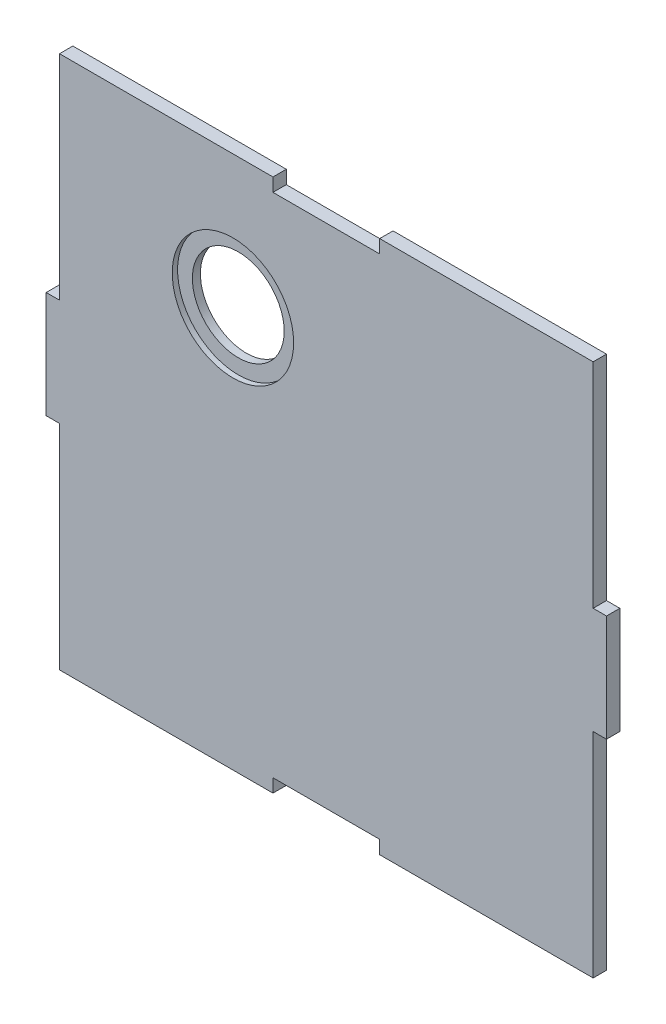
ISO-10303-21;
HEADER;
FILE_DESCRIPTION(('STEP AP214'),'2;1');
FILE_NAME('part.step','',(''),(''),'','','');
FILE_SCHEMA(('AUTOMOTIVE_DESIGN { 1 0 10303 214 1 1 1 1 }'));
ENDSEC;
DATA;
#1=APPLICATION_CONTEXT('core data for automotive mechanical design processes');
#2=APPLICATION_PROTOCOL_DEFINITION('international standard','automotive_design',2000,#1);
#3=PRODUCT_CONTEXT('',#1,'mechanical');
#4=PRODUCT('Part','Part','',(#3));
#5=PRODUCT_RELATED_PRODUCT_CATEGORY('part','',(#4));
#6=PRODUCT_DEFINITION_FORMATION('','',#4);
#7=PRODUCT_DEFINITION_CONTEXT('part definition',#1,'design');
#8=PRODUCT_DEFINITION('design','',#6,#7);
#9=PRODUCT_DEFINITION_SHAPE('','',#8);
#10=(LENGTH_UNIT() NAMED_UNIT(*) SI_UNIT(.MILLI.,.METRE.));
#11=(NAMED_UNIT(*) PLANE_ANGLE_UNIT() SI_UNIT($,.RADIAN.));
#12=(NAMED_UNIT(*) SI_UNIT($,.STERADIAN.) SOLID_ANGLE_UNIT());
#13=UNCERTAINTY_MEASURE_WITH_UNIT(LENGTH_MEASURE(1.E-05),#10,'distance_accuracy_value','');
#14=(GEOMETRIC_REPRESENTATION_CONTEXT(3) GLOBAL_UNCERTAINTY_ASSIGNED_CONTEXT((#13)) GLOBAL_UNIT_ASSIGNED_CONTEXT((#10,
#11,#12)) REPRESENTATION_CONTEXT('',''));
#15=CARTESIAN_POINT('',(0.,0.,0.));
#16=DIRECTION('',(0.,0.,1.));
#17=DIRECTION('',(1.,0.,0.));
#18=AXIS2_PLACEMENT_3D('',#15,#16,#17);
#19=CARTESIAN_POINT('',(-35.,50.,0.));
#20=DIRECTION('',(0.,0.,1.));
#21=DIRECTION('',(1.,0.,0.));
#22=AXIS2_PLACEMENT_3D('',#19,#20,#21);
#23=CYLINDRICAL_SURFACE('',#22,17.2);
#24=CARTESIAN_POINT('',(-35.,50.,0.));
#25=DIRECTION('',(0.,0.,1.));
#26=DIRECTION('',(1.,0.,0.));
#27=AXIS2_PLACEMENT_3D('',#24,#25,#26);
#28=CIRCLE('',#27,17.2);
#29=CARTESIAN_POINT('',(-17.8,50.,0.));
#30=VERTEX_POINT('',#29);
#31=EDGE_CURVE('E206',#30,#30,#28,.T.);
#32=ORIENTED_EDGE('',*,*,#31,.F.);
#33=EDGE_LOOP('',(#32));
#34=FACE_BOUND('',#33,.T.);
#35=CARTESIAN_POINT('',(-35.,50.,3.));
#36=DIRECTION('',(0.,0.,1.));
#37=DIRECTION('',(1.,0.,0.));
#38=AXIS2_PLACEMENT_3D('',#35,#36,#37);
#39=CIRCLE('',#38,17.2);
#40=CARTESIAN_POINT('',(-17.8,50.,3.));
#41=VERTEX_POINT('',#40);
#42=EDGE_CURVE('E36',#41,#41,#39,.F.);
#43=ORIENTED_EDGE('',*,*,#42,.F.);
#44=EDGE_LOOP('',(#43));
#45=FACE_BOUND('',#44,.T.);
#46=ADVANCED_FACE('F32',(#34,#45),#23,.F.);
#47=CARTESIAN_POINT('',(99.9999999999999,20.,5.));
#48=DIRECTION('',(-1.,0.,0.));
#49=DIRECTION('',(0.,-1.,0.));
#50=AXIS2_PLACEMENT_3D('',#47,#48,#49);
#51=PLANE('',#50);
#52=DIRECTION('',(0.,1.,0.));
#53=VECTOR('',#52,1.);
#54=CARTESIAN_POINT('',(99.9999999999999,20.,0.));
#55=LINE('',#54,#53);
#56=CARTESIAN_POINT('',(99.9999999999999,20.,0.));
#57=VERTEX_POINT('',#56);
#58=CARTESIAN_POINT('',(100.,100.,0.));
#59=VERTEX_POINT('',#58);
#60=EDGE_CURVE('E202',#57,#59,#55,.T.);
#61=ORIENTED_EDGE('',*,*,#60,.T.);
#62=DIRECTION('',(0.,0.,-1.));
#63=VECTOR('',#62,1.);
#64=CARTESIAN_POINT('',(100.,100.,5.));
#65=LINE('',#64,#63);
#66=CARTESIAN_POINT('',(100.,100.,5.));
#67=VERTEX_POINT('',#66);
#68=EDGE_CURVE('E11',#67,#59,#65,.T.);
#69=ORIENTED_EDGE('',*,*,#68,.F.);
#70=DIRECTION('',(0.,1.,0.));
#71=VECTOR('',#70,1.);
#72=CARTESIAN_POINT('',(99.9999999999999,20.,5.));
#73=LINE('',#72,#71);
#74=CARTESIAN_POINT('',(99.9999999999999,20.,5.));
#75=VERTEX_POINT('',#74);
#76=EDGE_CURVE('E241',#75,#67,#73,.T.);
#77=ORIENTED_EDGE('',*,*,#76,.F.);
#78=DIRECTION('',(0.,0.,-1.));
#79=VECTOR('',#78,1.);
#80=CARTESIAN_POINT('',(99.9999999999999,20.,5.));
#81=LINE('',#80,#79);
#82=EDGE_CURVE('E198',#75,#57,#81,.T.);
#83=ORIENTED_EDGE('',*,*,#82,.T.);
#84=EDGE_LOOP('',(#61,#69,#77,#83));
#85=FACE_BOUND('',#84,.T.);
#86=ADVANCED_FACE('F34',(#85),#51,.F.);
#87=CARTESIAN_POINT('',(20.,100.,5.));
#88=DIRECTION('',(0.,-1.,0.));
#89=DIRECTION('',(1.,0.,0.));
#90=AXIS2_PLACEMENT_3D('',#87,#88,#89);
#91=PLANE('',#90);
#92=DIRECTION('',(-1.,0.,0.));
#93=VECTOR('',#92,1.);
#94=CARTESIAN_POINT('',(20.,100.,0.));
#95=LINE('',#94,#93);
#96=CARTESIAN_POINT('',(20.,100.,0.));
#97=VERTEX_POINT('',#96);
#98=EDGE_CURVE('E205',#59,#97,#95,.T.);
#99=ORIENTED_EDGE('',*,*,#98,.T.);
#100=DIRECTION('',(0.,0.,-1.));
#101=VECTOR('',#100,1.);
#102=CARTESIAN_POINT('',(20.,100.,5.));
#103=LINE('',#102,#101);
#104=CARTESIAN_POINT('',(20.,100.,5.));
#105=VERTEX_POINT('',#104);
#106=EDGE_CURVE('E42',#105,#97,#103,.T.);
#107=ORIENTED_EDGE('',*,*,#106,.F.);
#108=DIRECTION('',(-1.,0.,0.));
#109=VECTOR('',#108,1.);
#110=CARTESIAN_POINT('',(20.,100.,5.));
#111=LINE('',#110,#109);
#112=EDGE_CURVE('E129',#67,#105,#111,.T.);
#113=ORIENTED_EDGE('',*,*,#112,.F.);
#114=ORIENTED_EDGE('',*,*,#68,.T.);
#115=EDGE_LOOP('',(#99,#107,#113,#114));
#116=FACE_BOUND('',#115,.T.);
#117=ADVANCED_FACE('F369',(#116),#91,.F.);
#118=CARTESIAN_POINT('',(20.,100.,5.));
#119=DIRECTION('',(1.,0.,0.));
#120=DIRECTION('',(0.,1.,0.));
#121=AXIS2_PLACEMENT_3D('',#118,#119,#120);
#122=PLANE('',#121);
#123=DIRECTION('',(0.,-1.,0.));
#124=VECTOR('',#123,1.);
#125=CARTESIAN_POINT('',(20.,100.,0.));
#126=LINE('',#125,#124);
#127=CARTESIAN_POINT('',(20.,95.,0.));
#128=VERTEX_POINT('',#127);
#129=EDGE_CURVE('E208',#97,#128,#126,.T.);
#130=ORIENTED_EDGE('',*,*,#129,.T.);
#131=DIRECTION('',(0.,0.,-1.));
#132=VECTOR('',#131,1.);
#133=CARTESIAN_POINT('',(20.,95.,5.));
#134=LINE('',#133,#132);
#135=CARTESIAN_POINT('',(20.,95.,5.));
#136=VERTEX_POINT('',#135);
#137=EDGE_CURVE('E284',#136,#128,#134,.T.);
#138=ORIENTED_EDGE('',*,*,#137,.F.);
#139=DIRECTION('',(0.,-1.,0.));
#140=VECTOR('',#139,1.);
#141=CARTESIAN_POINT('',(20.,100.,5.));
#142=LINE('',#141,#140);
#143=EDGE_CURVE('E293',#105,#136,#142,.T.);
#144=ORIENTED_EDGE('',*,*,#143,.F.);
#145=ORIENTED_EDGE('',*,*,#106,.T.);
#146=EDGE_LOOP('',(#130,#138,#144,#145));
#147=FACE_BOUND('',#146,.T.);
#148=ADVANCED_FACE('F291',(#147),#122,.F.);
#149=CARTESIAN_POINT('',(-20.,95.,5.));
#150=DIRECTION('',(0.,-1.,0.));
#151=DIRECTION('',(0.,0.,-1.));
#152=AXIS2_PLACEMENT_3D('',#149,#150,#151);
#153=PLANE('',#152);
#154=DIRECTION('',(-1.,0.,0.));
#155=VECTOR('',#154,1.);
#156=CARTESIAN_POINT('',(-20.,95.,0.));
#157=LINE('',#156,#155);
#158=CARTESIAN_POINT('',(-20.,95.,0.));
#159=VERTEX_POINT('',#158);
#160=EDGE_CURVE('E210',#128,#159,#157,.T.);
#161=ORIENTED_EDGE('',*,*,#160,.T.);
#162=DIRECTION('',(0.,0.,-1.));
#163=VECTOR('',#162,1.);
#164=CARTESIAN_POINT('',(-20.,95.,5.));
#165=LINE('',#164,#163);
#166=CARTESIAN_POINT('',(-20.,95.,5.));
#167=VERTEX_POINT('',#166);
#168=EDGE_CURVE('E281',#167,#159,#165,.T.);
#169=ORIENTED_EDGE('',*,*,#168,.F.);
#170=DIRECTION('',(-1.,0.,0.));
#171=VECTOR('',#170,1.);
#172=CARTESIAN_POINT('',(-20.,95.,5.));
#173=LINE('',#172,#171);
#174=EDGE_CURVE('E311',#136,#167,#173,.T.);
#175=ORIENTED_EDGE('',*,*,#174,.F.);
#176=ORIENTED_EDGE('',*,*,#137,.T.);
#177=EDGE_LOOP('',(#161,#169,#175,#176));
#178=FACE_BOUND('',#177,.T.);
#179=ADVANCED_FACE('F302',(#178),#153,.F.);
#180=CARTESIAN_POINT('',(-20.,100.,5.));
#181=DIRECTION('',(-1.,0.,0.));
#182=DIRECTION('',(0.,-1.,0.));
#183=AXIS2_PLACEMENT_3D('',#180,#181,#182);
#184=PLANE('',#183);
#185=DIRECTION('',(0.,1.,0.));
#186=VECTOR('',#185,1.);
#187=CARTESIAN_POINT('',(-20.,100.,0.));
#188=LINE('',#187,#186);
#189=CARTESIAN_POINT('',(-20.,100.,0.));
#190=VERTEX_POINT('',#189);
#191=EDGE_CURVE('E212',#159,#190,#188,.T.);
#192=ORIENTED_EDGE('',*,*,#191,.T.);
#193=DIRECTION('',(0.,0.,-1.));
#194=VECTOR('',#193,1.);
#195=CARTESIAN_POINT('',(-20.,100.,5.));
#196=LINE('',#195,#194);
#197=CARTESIAN_POINT('',(-20.,100.,5.));
#198=VERTEX_POINT('',#197);
#199=EDGE_CURVE('E278',#198,#190,#196,.T.);
#200=ORIENTED_EDGE('',*,*,#199,.F.);
#201=DIRECTION('',(0.,1.,0.));
#202=VECTOR('',#201,1.);
#203=CARTESIAN_POINT('',(-20.,100.,5.));
#204=LINE('',#203,#202);
#205=EDGE_CURVE('E308',#167,#198,#204,.T.);
#206=ORIENTED_EDGE('',*,*,#205,.F.);
#207=ORIENTED_EDGE('',*,*,#168,.T.);
#208=EDGE_LOOP('',(#192,#200,#206,#207));
#209=FACE_BOUND('',#208,.T.);
#210=ADVANCED_FACE('F306',(#209),#184,.F.);
#211=CARTESIAN_POINT('',(-100.,100.,5.));
#212=DIRECTION('',(0.,-1.,0.));
#213=DIRECTION('',(1.,0.,0.));
#214=AXIS2_PLACEMENT_3D('',#211,#212,#213);
#215=PLANE('',#214);
#216=DIRECTION('',(-1.,0.,0.));
#217=VECTOR('',#216,1.);
#218=CARTESIAN_POINT('',(-100.,100.,0.));
#219=LINE('',#218,#217);
#220=CARTESIAN_POINT('',(-100.,100.,0.));
#221=VERTEX_POINT('',#220);
#222=EDGE_CURVE('E214',#190,#221,#219,.T.);
#223=ORIENTED_EDGE('',*,*,#222,.T.);
#224=DIRECTION('',(0.,0.,-1.));
#225=VECTOR('',#224,1.);
#226=CARTESIAN_POINT('',(-100.,100.,5.));
#227=LINE('',#226,#225);
#228=CARTESIAN_POINT('',(-100.,100.,5.));
#229=VERTEX_POINT('',#228);
#230=EDGE_CURVE('E275',#229,#221,#227,.T.);
#231=ORIENTED_EDGE('',*,*,#230,.F.);
#232=DIRECTION('',(-1.,0.,0.));
#233=VECTOR('',#232,1.);
#234=CARTESIAN_POINT('',(-100.,100.,5.));
#235=LINE('',#234,#233);
#236=EDGE_CURVE('E310',#198,#229,#235,.T.);
#237=ORIENTED_EDGE('',*,*,#236,.F.);
#238=ORIENTED_EDGE('',*,*,#199,.T.);
#239=EDGE_LOOP('',(#223,#231,#237,#238));
#240=FACE_BOUND('',#239,.T.);
#241=ADVANCED_FACE('F529',(#240),#215,.F.);
#242=CARTESIAN_POINT('',(-100.,20.,5.));
#243=DIRECTION('',(1.,0.,0.));
#244=DIRECTION('',(0.,1.,0.));
#245=AXIS2_PLACEMENT_3D('',#242,#243,#244);
#246=PLANE('',#245);
#247=DIRECTION('',(0.,-1.,0.));
#248=VECTOR('',#247,1.);
#249=CARTESIAN_POINT('',(-100.,20.,0.));
#250=LINE('',#249,#248);
#251=CARTESIAN_POINT('',(-100.,20.,0.));
#252=VERTEX_POINT('',#251);
#253=EDGE_CURVE('E216',#221,#252,#250,.T.);
#254=ORIENTED_EDGE('',*,*,#253,.T.);
#255=DIRECTION('',(0.,0.,-1.));
#256=VECTOR('',#255,1.);
#257=CARTESIAN_POINT('',(-100.,20.,5.));
#258=LINE('',#257,#256);
#259=CARTESIAN_POINT('',(-100.,20.,5.));
#260=VERTEX_POINT('',#259);
#261=EDGE_CURVE('E272',#260,#252,#258,.T.);
#262=ORIENTED_EDGE('',*,*,#261,.F.);
#263=DIRECTION('',(0.,-1.,0.));
#264=VECTOR('',#263,1.);
#265=CARTESIAN_POINT('',(-100.,20.,5.));
#266=LINE('',#265,#264);
#267=EDGE_CURVE('E313',#229,#260,#266,.T.);
#268=ORIENTED_EDGE('',*,*,#267,.F.);
#269=ORIENTED_EDGE('',*,*,#230,.T.);
#270=EDGE_LOOP('',(#254,#262,#268,#269));
#271=FACE_BOUND('',#270,.T.);
#272=ADVANCED_FACE('F520',(#271),#246,.F.);
#273=CARTESIAN_POINT('',(-100.,20.,5.));
#274=DIRECTION('',(0.,-1.,0.));
#275=DIRECTION('',(1.,0.,0.));
#276=AXIS2_PLACEMENT_3D('',#273,#274,#275);
#277=PLANE('',#276);
#278=DIRECTION('',(-1.,0.,0.));
#279=VECTOR('',#278,1.);
#280=CARTESIAN_POINT('',(-100.,20.,0.));
#281=LINE('',#280,#279);
#282=CARTESIAN_POINT('',(-105.,20.,0.));
#283=VERTEX_POINT('',#282);
#284=EDGE_CURVE('E218',#252,#283,#281,.T.);
#285=ORIENTED_EDGE('',*,*,#284,.T.);
#286=DIRECTION('',(0.,0.,-1.));
#287=VECTOR('',#286,1.);
#288=CARTESIAN_POINT('',(-105.,20.,5.));
#289=LINE('',#288,#287);
#290=CARTESIAN_POINT('',(-105.,20.,5.));
#291=VERTEX_POINT('',#290);
#292=EDGE_CURVE('E269',#291,#283,#289,.T.);
#293=ORIENTED_EDGE('',*,*,#292,.F.);
#294=DIRECTION('',(-1.,0.,0.));
#295=VECTOR('',#294,1.);
#296=CARTESIAN_POINT('',(-100.,20.,5.));
#297=LINE('',#296,#295);
#298=EDGE_CURVE('E319',#260,#291,#297,.T.);
#299=ORIENTED_EDGE('',*,*,#298,.F.);
#300=ORIENTED_EDGE('',*,*,#261,.T.);
#301=EDGE_LOOP('',(#285,#293,#299,#300));
#302=FACE_BOUND('',#301,.T.);
#303=ADVANCED_FACE('F511',(#302),#277,.F.);
#304=CARTESIAN_POINT('',(-105.,20.,5.));
#305=DIRECTION('',(1.,0.,0.));
#306=DIRECTION('',(0.,1.,0.));
#307=AXIS2_PLACEMENT_3D('',#304,#305,#306);
#308=PLANE('',#307);
#309=DIRECTION('',(0.,-1.,0.));
#310=VECTOR('',#309,1.);
#311=CARTESIAN_POINT('',(-105.,20.,0.));
#312=LINE('',#311,#310);
#313=CARTESIAN_POINT('',(-105.,-20.,0.));
#314=VERTEX_POINT('',#313);
#315=EDGE_CURVE('E220',#283,#314,#312,.T.);
#316=ORIENTED_EDGE('',*,*,#315,.T.);
#317=DIRECTION('',(0.,0.,-1.));
#318=VECTOR('',#317,1.);
#319=CARTESIAN_POINT('',(-105.,-20.,5.));
#320=LINE('',#319,#318);
#321=CARTESIAN_POINT('',(-105.,-20.,5.));
#322=VERTEX_POINT('',#321);
#323=EDGE_CURVE('E266',#322,#314,#320,.T.);
#324=ORIENTED_EDGE('',*,*,#323,.F.);
#325=DIRECTION('',(0.,-1.,0.));
#326=VECTOR('',#325,1.);
#327=CARTESIAN_POINT('',(-105.,20.,5.));
#328=LINE('',#327,#326);
#329=EDGE_CURVE('E321',#291,#322,#328,.T.);
#330=ORIENTED_EDGE('',*,*,#329,.F.);
#331=ORIENTED_EDGE('',*,*,#292,.T.);
#332=EDGE_LOOP('',(#316,#324,#330,#331));
#333=FACE_BOUND('',#332,.T.);
#334=ADVANCED_FACE('F502',(#333),#308,.F.);
#335=CARTESIAN_POINT('',(-100.,-20.,5.));
#336=DIRECTION('',(0.,1.,0.));
#337=DIRECTION('',(-1.,0.,0.));
#338=AXIS2_PLACEMENT_3D('',#335,#336,#337);
#339=PLANE('',#338);
#340=DIRECTION('',(1.,0.,0.));
#341=VECTOR('',#340,1.);
#342=CARTESIAN_POINT('',(-100.,-20.,0.));
#343=LINE('',#342,#341);
#344=CARTESIAN_POINT('',(-100.,-20.,0.));
#345=VERTEX_POINT('',#344);
#346=EDGE_CURVE('E222',#314,#345,#343,.T.);
#347=ORIENTED_EDGE('',*,*,#346,.T.);
#348=DIRECTION('',(0.,0.,-1.));
#349=VECTOR('',#348,1.);
#350=CARTESIAN_POINT('',(-100.,-20.,5.));
#351=LINE('',#350,#349);
#352=CARTESIAN_POINT('',(-100.,-20.,5.));
#353=VERTEX_POINT('',#352);
#354=EDGE_CURVE('E263',#353,#345,#351,.T.);
#355=ORIENTED_EDGE('',*,*,#354,.F.);
#356=DIRECTION('',(1.,0.,0.));
#357=VECTOR('',#356,1.);
#358=CARTESIAN_POINT('',(-100.,-20.,5.));
#359=LINE('',#358,#357);
#360=EDGE_CURVE('E323',#322,#353,#359,.T.);
#361=ORIENTED_EDGE('',*,*,#360,.F.);
#362=ORIENTED_EDGE('',*,*,#323,.T.);
#363=EDGE_LOOP('',(#347,#355,#361,#362));
#364=FACE_BOUND('',#363,.T.);
#365=ADVANCED_FACE('F493',(#364),#339,.F.);
#366=CARTESIAN_POINT('',(-100.,-100.,5.));
#367=DIRECTION('',(1.,0.,0.));
#368=DIRECTION('',(0.,1.,0.));
#369=AXIS2_PLACEMENT_3D('',#366,#367,#368);
#370=PLANE('',#369);
#371=DIRECTION('',(0.,-1.,0.));
#372=VECTOR('',#371,1.);
#373=CARTESIAN_POINT('',(-100.,-100.,0.));
#374=LINE('',#373,#372);
#375=CARTESIAN_POINT('',(-100.,-100.,0.));
#376=VERTEX_POINT('',#375);
#377=EDGE_CURVE('E224',#345,#376,#374,.T.);
#378=ORIENTED_EDGE('',*,*,#377,.T.);
#379=DIRECTION('',(0.,0.,-1.));
#380=VECTOR('',#379,1.);
#381=CARTESIAN_POINT('',(-100.,-100.,5.));
#382=LINE('',#381,#380);
#383=CARTESIAN_POINT('',(-100.,-100.,5.));
#384=VERTEX_POINT('',#383);
#385=EDGE_CURVE('E260',#384,#376,#382,.T.);
#386=ORIENTED_EDGE('',*,*,#385,.F.);
#387=DIRECTION('',(0.,-1.,0.));
#388=VECTOR('',#387,1.);
#389=CARTESIAN_POINT('',(-100.,-100.,5.));
#390=LINE('',#389,#388);
#391=EDGE_CURVE('E325',#353,#384,#390,.T.);
#392=ORIENTED_EDGE('',*,*,#391,.F.);
#393=ORIENTED_EDGE('',*,*,#354,.T.);
#394=EDGE_LOOP('',(#378,#386,#392,#393));
#395=FACE_BOUND('',#394,.T.);
#396=ADVANCED_FACE('F484',(#395),#370,.F.);
#397=CARTESIAN_POINT('',(-100.,-100.,5.));
#398=DIRECTION('',(0.,1.,0.));
#399=DIRECTION('',(-1.,0.,0.));
#400=AXIS2_PLACEMENT_3D('',#397,#398,#399);
#401=PLANE('',#400);
#402=DIRECTION('',(1.,0.,0.));
#403=VECTOR('',#402,1.);
#404=CARTESIAN_POINT('',(-100.,-100.,0.));
#405=LINE('',#404,#403);
#406=CARTESIAN_POINT('',(-20.,-100.,0.));
#407=VERTEX_POINT('',#406);
#408=EDGE_CURVE('E226',#376,#407,#405,.T.);
#409=ORIENTED_EDGE('',*,*,#408,.T.);
#410=DIRECTION('',(0.,0.,-1.));
#411=VECTOR('',#410,1.);
#412=CARTESIAN_POINT('',(-20.,-100.,5.));
#413=LINE('',#412,#411);
#414=CARTESIAN_POINT('',(-20.,-100.,5.));
#415=VERTEX_POINT('',#414);
#416=EDGE_CURVE('E257',#415,#407,#413,.T.);
#417=ORIENTED_EDGE('',*,*,#416,.F.);
#418=DIRECTION('',(1.,0.,0.));
#419=VECTOR('',#418,1.);
#420=CARTESIAN_POINT('',(-100.,-100.,5.));
#421=LINE('',#420,#419);
#422=EDGE_CURVE('E327',#384,#415,#421,.T.);
#423=ORIENTED_EDGE('',*,*,#422,.F.);
#424=ORIENTED_EDGE('',*,*,#385,.T.);
#425=EDGE_LOOP('',(#409,#417,#423,#424));
#426=FACE_BOUND('',#425,.T.);
#427=ADVANCED_FACE('F475',(#426),#401,.F.);
#428=CARTESIAN_POINT('',(-20.,-100.,5.));
#429=DIRECTION('',(-1.,0.,0.));
#430=DIRECTION('',(0.,-1.,0.));
#431=AXIS2_PLACEMENT_3D('',#428,#429,#430);
#432=PLANE('',#431);
#433=DIRECTION('',(0.,1.,0.));
#434=VECTOR('',#433,1.);
#435=CARTESIAN_POINT('',(-20.,-100.,0.));
#436=LINE('',#435,#434);
#437=CARTESIAN_POINT('',(-19.9999999999999,-95.,0.));
#438=VERTEX_POINT('',#437);
#439=EDGE_CURVE('E228',#407,#438,#436,.T.);
#440=ORIENTED_EDGE('',*,*,#439,.T.);
#441=DIRECTION('',(0.,0.,-1.));
#442=VECTOR('',#441,1.);
#443=CARTESIAN_POINT('',(-19.9999999999999,-95.,5.));
#444=LINE('',#443,#442);
#445=CARTESIAN_POINT('',(-19.9999999999999,-95.,5.));
#446=VERTEX_POINT('',#445);
#447=EDGE_CURVE('E254',#446,#438,#444,.T.);
#448=ORIENTED_EDGE('',*,*,#447,.F.);
#449=DIRECTION('',(0.,1.,0.));
#450=VECTOR('',#449,1.);
#451=CARTESIAN_POINT('',(-20.,-100.,5.));
#452=LINE('',#451,#450);
#453=EDGE_CURVE('E329',#415,#446,#452,.T.);
#454=ORIENTED_EDGE('',*,*,#453,.F.);
#455=ORIENTED_EDGE('',*,*,#416,.T.);
#456=EDGE_LOOP('',(#440,#448,#454,#455));
#457=FACE_BOUND('',#456,.T.);
#458=ADVANCED_FACE('F466',(#457),#432,.F.);
#459=CARTESIAN_POINT('',(-19.9999999999999,-95.,5.));
#460=DIRECTION('',(0.,1.,0.));
#461=DIRECTION('',(0.,0.,1.));
#462=AXIS2_PLACEMENT_3D('',#459,#460,#461);
#463=PLANE('',#462);
#464=DIRECTION('',(1.,0.,0.));
#465=VECTOR('',#464,1.);
#466=CARTESIAN_POINT('',(-19.9999999999999,-95.,0.));
#467=LINE('',#466,#465);
#468=CARTESIAN_POINT('',(20.,-95.,0.));
#469=VERTEX_POINT('',#468);
#470=EDGE_CURVE('E230',#438,#469,#467,.T.);
#471=ORIENTED_EDGE('',*,*,#470,.T.);
#472=DIRECTION('',(0.,0.,-1.));
#473=VECTOR('',#472,1.);
#474=CARTESIAN_POINT('',(20.,-95.,5.));
#475=LINE('',#474,#473);
#476=CARTESIAN_POINT('',(20.,-95.,5.));
#477=VERTEX_POINT('',#476);
#478=EDGE_CURVE('E251',#477,#469,#475,.T.);
#479=ORIENTED_EDGE('',*,*,#478,.F.);
#480=DIRECTION('',(1.,0.,0.));
#481=VECTOR('',#480,1.);
#482=CARTESIAN_POINT('',(-19.9999999999999,-95.,5.));
#483=LINE('',#482,#481);
#484=EDGE_CURVE('E331',#446,#477,#483,.T.);
#485=ORIENTED_EDGE('',*,*,#484,.F.);
#486=ORIENTED_EDGE('',*,*,#447,.T.);
#487=EDGE_LOOP('',(#471,#479,#485,#486));
#488=FACE_BOUND('',#487,.T.);
#489=ADVANCED_FACE('F457',(#488),#463,.F.);
#490=CARTESIAN_POINT('',(20.,-100.,5.));
#491=DIRECTION('',(1.,0.,0.));
#492=DIRECTION('',(0.,1.,0.));
#493=AXIS2_PLACEMENT_3D('',#490,#491,#492);
#494=PLANE('',#493);
#495=DIRECTION('',(0.,-1.,0.));
#496=VECTOR('',#495,1.);
#497=CARTESIAN_POINT('',(20.,-100.,0.));
#498=LINE('',#497,#496);
#499=CARTESIAN_POINT('',(20.,-100.,0.));
#500=VERTEX_POINT('',#499);
#501=EDGE_CURVE('E232',#469,#500,#498,.T.);
#502=ORIENTED_EDGE('',*,*,#501,.T.);
#503=DIRECTION('',(0.,0.,-1.));
#504=VECTOR('',#503,1.);
#505=CARTESIAN_POINT('',(20.,-100.,5.));
#506=LINE('',#505,#504);
#507=CARTESIAN_POINT('',(20.,-100.,5.));
#508=VERTEX_POINT('',#507);
#509=EDGE_CURVE('E248',#508,#500,#506,.T.);
#510=ORIENTED_EDGE('',*,*,#509,.F.);
#511=DIRECTION('',(0.,-1.,0.));
#512=VECTOR('',#511,1.);
#513=CARTESIAN_POINT('',(20.,-100.,5.));
#514=LINE('',#513,#512);
#515=EDGE_CURVE('E333',#477,#508,#514,.T.);
#516=ORIENTED_EDGE('',*,*,#515,.F.);
#517=ORIENTED_EDGE('',*,*,#478,.T.);
#518=EDGE_LOOP('',(#502,#510,#516,#517));
#519=FACE_BOUND('',#518,.T.);
#520=ADVANCED_FACE('F449',(#519),#494,.F.);
#521=CARTESIAN_POINT('',(20.,-100.,5.));
#522=DIRECTION('',(0.,1.,0.));
#523=DIRECTION('',(-1.,0.,0.));
#524=AXIS2_PLACEMENT_3D('',#521,#522,#523);
#525=PLANE('',#524);
#526=DIRECTION('',(1.,0.,0.));
#527=VECTOR('',#526,1.);
#528=CARTESIAN_POINT('',(20.,-100.,0.));
#529=LINE('',#528,#527);
#530=CARTESIAN_POINT('',(100.,-100.,0.));
#531=VERTEX_POINT('',#530);
#532=EDGE_CURVE('E234',#500,#531,#529,.T.);
#533=ORIENTED_EDGE('',*,*,#532,.T.);
#534=DIRECTION('',(0.,0.,-1.));
#535=VECTOR('',#534,1.);
#536=CARTESIAN_POINT('',(100.,-100.,5.));
#537=LINE('',#536,#535);
#538=CARTESIAN_POINT('',(100.,-100.,5.));
#539=VERTEX_POINT('',#538);
#540=EDGE_CURVE('E245',#539,#531,#537,.T.);
#541=ORIENTED_EDGE('',*,*,#540,.F.);
#542=DIRECTION('',(1.,0.,0.));
#543=VECTOR('',#542,1.);
#544=CARTESIAN_POINT('',(20.,-100.,5.));
#545=LINE('',#544,#543);
#546=EDGE_CURVE('E335',#508,#539,#545,.T.);
#547=ORIENTED_EDGE('',*,*,#546,.F.);
#548=ORIENTED_EDGE('',*,*,#509,.T.);
#549=EDGE_LOOP('',(#533,#541,#547,#548));
#550=FACE_BOUND('',#549,.T.);
#551=ADVANCED_FACE('F341',(#550),#525,.F.);
#552=CARTESIAN_POINT('',(100.,-100.,5.));
#553=DIRECTION('',(-1.,0.,0.));
#554=DIRECTION('',(0.,-1.,0.));
#555=AXIS2_PLACEMENT_3D('',#552,#553,#554);
#556=PLANE('',#555);
#557=DIRECTION('',(0.,1.,0.));
#558=VECTOR('',#557,1.);
#559=CARTESIAN_POINT('',(100.,-100.,0.));
#560=LINE('',#559,#558);
#561=CARTESIAN_POINT('',(99.9999999999999,-20.,0.));
#562=VERTEX_POINT('',#561);
#563=EDGE_CURVE('E236',#531,#562,#560,.T.);
#564=ORIENTED_EDGE('',*,*,#563,.T.);
#565=DIRECTION('',(0.,0.,-1.));
#566=VECTOR('',#565,1.);
#567=CARTESIAN_POINT('',(99.9999999999999,-20.,5.));
#568=LINE('',#567,#566);
#569=CARTESIAN_POINT('',(99.9999999999999,-20.,5.));
#570=VERTEX_POINT('',#569);
#571=EDGE_CURVE('E193',#570,#562,#568,.T.);
#572=ORIENTED_EDGE('',*,*,#571,.F.);
#573=DIRECTION('',(0.,1.,0.));
#574=VECTOR('',#573,1.);
#575=CARTESIAN_POINT('',(100.,-100.,5.));
#576=LINE('',#575,#574);
#577=EDGE_CURVE('E184',#539,#570,#576,.T.);
#578=ORIENTED_EDGE('',*,*,#577,.F.);
#579=ORIENTED_EDGE('',*,*,#540,.T.);
#580=EDGE_LOOP('',(#564,#572,#578,#579));
#581=FACE_BOUND('',#580,.T.);
#582=ADVANCED_FACE('F345',(#581),#556,.F.);
#583=CARTESIAN_POINT('',(99.9999999999999,-20.,5.));
#584=DIRECTION('',(0.,1.,0.));
#585=DIRECTION('',(-1.,0.,0.));
#586=AXIS2_PLACEMENT_3D('',#583,#584,#585);
#587=PLANE('',#586);
#588=DIRECTION('',(1.,0.,0.));
#589=VECTOR('',#588,1.);
#590=CARTESIAN_POINT('',(99.9999999999999,-20.,0.));
#591=LINE('',#590,#589);
#592=CARTESIAN_POINT('',(105.,-20.,0.));
#593=VERTEX_POINT('',#592);
#594=EDGE_CURVE('E192',#562,#593,#591,.T.);
#595=ORIENTED_EDGE('',*,*,#594,.T.);
#596=DIRECTION('',(0.,0.,-1.));
#597=VECTOR('',#596,1.);
#598=CARTESIAN_POINT('',(105.,-20.,5.));
#599=LINE('',#598,#597);
#600=CARTESIAN_POINT('',(105.,-20.,5.));
#601=VERTEX_POINT('',#600);
#602=EDGE_CURVE('E189',#601,#593,#599,.T.);
#603=ORIENTED_EDGE('',*,*,#602,.F.);
#604=DIRECTION('',(1.,0.,0.));
#605=VECTOR('',#604,1.);
#606=CARTESIAN_POINT('',(99.9999999999999,-20.,5.));
#607=LINE('',#606,#605);
#608=EDGE_CURVE('E178',#570,#601,#607,.T.);
#609=ORIENTED_EDGE('',*,*,#608,.F.);
#610=ORIENTED_EDGE('',*,*,#571,.T.);
#611=EDGE_LOOP('',(#595,#603,#609,#610));
#612=FACE_BOUND('',#611,.T.);
#613=ADVANCED_FACE('F190',(#612),#587,.F.);
#614=CARTESIAN_POINT('',(105.,20.,5.));
#615=DIRECTION('',(-1.,0.,0.));
#616=DIRECTION('',(0.,-1.,0.));
#617=AXIS2_PLACEMENT_3D('',#614,#615,#616);
#618=PLANE('',#617);
#619=DIRECTION('',(0.,1.,0.));
#620=VECTOR('',#619,1.);
#621=CARTESIAN_POINT('',(105.,20.,0.));
#622=LINE('',#621,#620);
#623=CARTESIAN_POINT('',(105.,20.,0.));
#624=VERTEX_POINT('',#623);
#625=EDGE_CURVE('E115',#593,#624,#622,.T.);
#626=ORIENTED_EDGE('',*,*,#625,.T.);
#627=DIRECTION('',(0.,0.,-1.));
#628=VECTOR('',#627,1.);
#629=CARTESIAN_POINT('',(105.,20.,5.));
#630=LINE('',#629,#628);
#631=CARTESIAN_POINT('',(105.,20.,5.));
#632=VERTEX_POINT('',#631);
#633=EDGE_CURVE('E194',#632,#624,#630,.T.);
#634=ORIENTED_EDGE('',*,*,#633,.F.);
#635=DIRECTION('',(0.,1.,0.));
#636=VECTOR('',#635,1.);
#637=CARTESIAN_POINT('',(105.,20.,5.));
#638=LINE('',#637,#636);
#639=EDGE_CURVE('E182',#601,#632,#638,.T.);
#640=ORIENTED_EDGE('',*,*,#639,.F.);
#641=ORIENTED_EDGE('',*,*,#602,.T.);
#642=EDGE_LOOP('',(#626,#634,#640,#641));
#643=FACE_BOUND('',#642,.T.);
#644=ADVANCED_FACE('F196',(#643),#618,.F.);
#645=CARTESIAN_POINT('',(99.9999999999999,20.,5.));
#646=DIRECTION('',(0.,-1.,0.));
#647=DIRECTION('',(1.,0.,0.));
#648=AXIS2_PLACEMENT_3D('',#645,#646,#647);
#649=PLANE('',#648);
#650=DIRECTION('',(-1.,0.,0.));
#651=VECTOR('',#650,1.);
#652=CARTESIAN_POINT('',(99.9999999999999,20.,0.));
#653=LINE('',#652,#651);
#654=EDGE_CURVE('E121',#624,#57,#653,.T.);
#655=ORIENTED_EDGE('',*,*,#654,.T.);
#656=ORIENTED_EDGE('',*,*,#82,.F.);
#657=DIRECTION('',(-1.,0.,0.));
#658=VECTOR('',#657,1.);
#659=CARTESIAN_POINT('',(99.9999999999999,20.,5.));
#660=LINE('',#659,#658);
#661=EDGE_CURVE('E50',#632,#75,#660,.T.);
#662=ORIENTED_EDGE('',*,*,#661,.F.);
#663=ORIENTED_EDGE('',*,*,#633,.T.);
#664=EDGE_LOOP('',(#655,#656,#662,#663));
#665=FACE_BOUND('',#664,.T.);
#666=ADVANCED_FACE('F349',(#665),#649,.F.);
#667=CARTESIAN_POINT('',(0.,0.,5.));
#668=DIRECTION('',(0.,0.,-1.));
#669=DIRECTION('',(-1.,0.,0.));
#670=AXIS2_PLACEMENT_3D('',#667,#668,#669);
#671=PLANE('',#670);
#672=CARTESIAN_POINT('',(-35.,50.,5.));
#673=DIRECTION('',(0.,0.,1.));
#674=DIRECTION('',(1.,0.,0.));
#675=AXIS2_PLACEMENT_3D('',#672,#673,#674);
#676=CIRCLE('',#675,22.75);
#677=CARTESIAN_POINT('',(-12.25,50.,5.));
#678=VERTEX_POINT('',#677);
#679=EDGE_CURVE('E386',#678,#678,#676,.T.);
#680=ORIENTED_EDGE('',*,*,#679,.F.);
#681=EDGE_LOOP('',(#680));
#682=FACE_BOUND('',#681,.T.);
#683=ORIENTED_EDGE('',*,*,#76,.T.);
#684=ORIENTED_EDGE('',*,*,#112,.T.);
#685=ORIENTED_EDGE('',*,*,#143,.T.);
#686=ORIENTED_EDGE('',*,*,#174,.T.);
#687=ORIENTED_EDGE('',*,*,#205,.T.);
#688=ORIENTED_EDGE('',*,*,#236,.T.);
#689=ORIENTED_EDGE('',*,*,#267,.T.);
#690=ORIENTED_EDGE('',*,*,#298,.T.);
#691=ORIENTED_EDGE('',*,*,#329,.T.);
#692=ORIENTED_EDGE('',*,*,#360,.T.);
#693=ORIENTED_EDGE('',*,*,#391,.T.);
#694=ORIENTED_EDGE('',*,*,#422,.T.);
#695=ORIENTED_EDGE('',*,*,#453,.T.);
#696=ORIENTED_EDGE('',*,*,#484,.T.);
#697=ORIENTED_EDGE('',*,*,#515,.T.);
#698=ORIENTED_EDGE('',*,*,#546,.T.);
#699=ORIENTED_EDGE('',*,*,#577,.T.);
#700=ORIENTED_EDGE('',*,*,#608,.T.);
#701=ORIENTED_EDGE('',*,*,#639,.T.);
#702=ORIENTED_EDGE('',*,*,#661,.T.);
#703=EDGE_LOOP('',(#683,#684,#685,#686,#687,#688,#689,#690,#691,#692,#693,#694,#695,#696,#697,
#698,#699,#700,#701,#702));
#704=FACE_BOUND('',#703,.T.);
#705=ADVANCED_FACE('F180',(#682,#704),#671,.F.);
#706=CARTESIAN_POINT('',(0.,0.,0.));
#707=DIRECTION('',(0.,0.,-1.));
#708=DIRECTION('',(-1.,0.,0.));
#709=AXIS2_PLACEMENT_3D('',#706,#707,#708);
#710=PLANE('',#709);
#711=ORIENTED_EDGE('',*,*,#31,.T.);
#712=EDGE_LOOP('',(#711));
#713=FACE_BOUND('',#712,.T.);
#714=ORIENTED_EDGE('',*,*,#60,.F.);
#715=ORIENTED_EDGE('',*,*,#654,.F.);
#716=ORIENTED_EDGE('',*,*,#625,.F.);
#717=ORIENTED_EDGE('',*,*,#594,.F.);
#718=ORIENTED_EDGE('',*,*,#563,.F.);
#719=ORIENTED_EDGE('',*,*,#532,.F.);
#720=ORIENTED_EDGE('',*,*,#501,.F.);
#721=ORIENTED_EDGE('',*,*,#470,.F.);
#722=ORIENTED_EDGE('',*,*,#439,.F.);
#723=ORIENTED_EDGE('',*,*,#408,.F.);
#724=ORIENTED_EDGE('',*,*,#377,.F.);
#725=ORIENTED_EDGE('',*,*,#346,.F.);
#726=ORIENTED_EDGE('',*,*,#315,.F.);
#727=ORIENTED_EDGE('',*,*,#284,.F.);
#728=ORIENTED_EDGE('',*,*,#253,.F.);
#729=ORIENTED_EDGE('',*,*,#222,.F.);
#730=ORIENTED_EDGE('',*,*,#191,.F.);
#731=ORIENTED_EDGE('',*,*,#160,.F.);
#732=ORIENTED_EDGE('',*,*,#129,.F.);
#733=ORIENTED_EDGE('',*,*,#98,.F.);
#734=EDGE_LOOP('',(#714,#715,#716,#717,#718,#719,#720,#721,#722,#723,#724,#725,#726,#727,#728,
#729,#730,#731,#732,#733));
#735=FACE_BOUND('',#734,.T.);
#736=ADVANCED_FACE('F297',(#713,#735),#710,.T.);
#737=CARTESIAN_POINT('',(-35.,50.,3.));
#738=DIRECTION('',(0.,0.,1.));
#739=DIRECTION('',(1.,0.,0.));
#740=AXIS2_PLACEMENT_3D('',#737,#738,#739);
#741=PLANE('',#740);
#742=CARTESIAN_POINT('',(-35.,50.,3.));
#743=DIRECTION('',(0.,0.,1.));
#744=DIRECTION('',(1.,0.,0.));
#745=AXIS2_PLACEMENT_3D('',#742,#743,#744);
#746=CIRCLE('',#745,22.75);
#747=CARTESIAN_POINT('',(-12.25,50.,3.));
#748=VERTEX_POINT('',#747);
#749=EDGE_CURVE('E383',#748,#748,#746,.T.);
#750=ORIENTED_EDGE('',*,*,#749,.T.);
#751=EDGE_LOOP('',(#750));
#752=FACE_BOUND('',#751,.T.);
#753=ORIENTED_EDGE('',*,*,#42,.T.);
#754=EDGE_LOOP('',(#753));
#755=FACE_BOUND('',#754,.T.);
#756=ADVANCED_FACE('F376',(#752,#755),#741,.T.);
#757=CARTESIAN_POINT('',(-35.,50.,3.));
#758=DIRECTION('',(0.,0.,1.));
#759=DIRECTION('',(1.,0.,0.));
#760=AXIS2_PLACEMENT_3D('',#757,#758,#759);
#761=CYLINDRICAL_SURFACE('',#760,22.75);
#762=ORIENTED_EDGE('',*,*,#749,.F.);
#763=EDGE_LOOP('',(#762));
#764=FACE_BOUND('',#763,.T.);
#765=ORIENTED_EDGE('',*,*,#679,.T.);
#766=EDGE_LOOP('',(#765));
#767=FACE_BOUND('',#766,.T.);
#768=ADVANCED_FACE('F373',(#764,#767),#761,.F.);
#769=CLOSED_SHELL('',(#46,#86,#117,#148,#179,#210,#241,#272,#303,#334,#365,#396,#427,#458,#489,
#520,#551,#582,#613,#644,#666,#705,#736,#756,#768));
#770=MANIFOLD_SOLID_BREP('B2',#769);
#771=ADVANCED_BREP_SHAPE_REPRESENTATION('',(#18,#770),#14);
#772=SHAPE_DEFINITION_REPRESENTATION(#9,#771);
ENDSEC;
END-ISO-10303-21;
